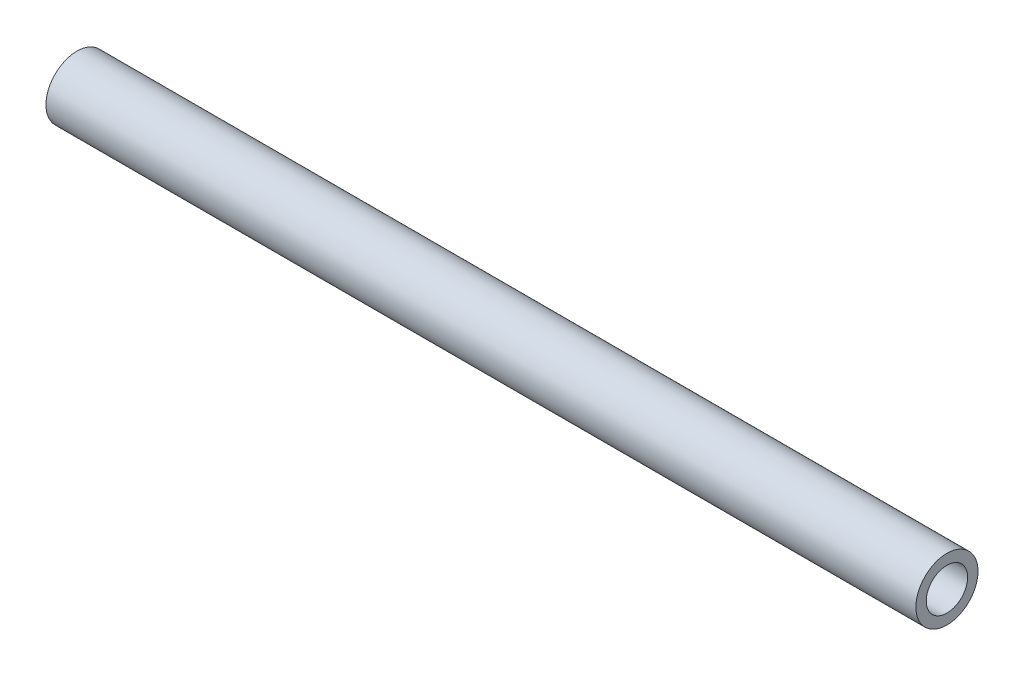
ISO-10303-21;
HEADER;
FILE_DESCRIPTION(('STEP AP214'),'2;1');
FILE_NAME('part.step','',(''),(''),'','','');
FILE_SCHEMA(('AUTOMOTIVE_DESIGN { 1 0 10303 214 1 1 1 1 }'));
ENDSEC;
DATA;
#1=APPLICATION_CONTEXT('core data for automotive mechanical design processes');
#2=APPLICATION_PROTOCOL_DEFINITION('international standard','automotive_design',2000,#1);
#3=PRODUCT_CONTEXT('',#1,'mechanical');
#4=PRODUCT('Part','Part','',(#3));
#5=PRODUCT_RELATED_PRODUCT_CATEGORY('part','',(#4));
#6=PRODUCT_DEFINITION_FORMATION('','',#4);
#7=PRODUCT_DEFINITION_CONTEXT('part definition',#1,'design');
#8=PRODUCT_DEFINITION('design','',#6,#7);
#9=PRODUCT_DEFINITION_SHAPE('','',#8);
#10=(LENGTH_UNIT() NAMED_UNIT(*) SI_UNIT(.MILLI.,.METRE.));
#11=(NAMED_UNIT(*) PLANE_ANGLE_UNIT() SI_UNIT($,.RADIAN.));
#12=(NAMED_UNIT(*) SI_UNIT($,.STERADIAN.) SOLID_ANGLE_UNIT());
#13=UNCERTAINTY_MEASURE_WITH_UNIT(LENGTH_MEASURE(1.E-05),#10,'distance_accuracy_value','');
#14=(GEOMETRIC_REPRESENTATION_CONTEXT(3) GLOBAL_UNCERTAINTY_ASSIGNED_CONTEXT((#13)) GLOBAL_UNIT_ASSIGNED_CONTEXT((#10,
#11,#12)) REPRESENTATION_CONTEXT('',''));
#15=CARTESIAN_POINT('',(0.,0.,0.));
#16=DIRECTION('',(0.,0.,1.));
#17=DIRECTION('',(1.,0.,0.));
#18=AXIS2_PLACEMENT_3D('',#15,#16,#17);
#19=CARTESIAN_POINT('',(266.7,0.,0.));
#20=DIRECTION('',(1.,0.,0.));
#21=DIRECTION('',(0.,0.,-1.));
#22=AXIS2_PLACEMENT_3D('',#19,#20,#21);
#23=PLANE('',#22);
#24=CARTESIAN_POINT('',(266.7,0.,0.));
#25=DIRECTION('',(1.,0.,0.));
#26=DIRECTION('',(0.,0.,-1.));
#27=AXIS2_PLACEMENT_3D('',#24,#25,#26);
#28=CIRCLE('',#27,9.525);
#29=CARTESIAN_POINT('',(266.7,0.,-9.525));
#30=VERTEX_POINT('',#29);
#31=EDGE_CURVE('E10',#30,#30,#28,.T.);
#32=ORIENTED_EDGE('',*,*,#31,.T.);
#33=EDGE_LOOP('',(#32));
#34=FACE_BOUND('',#33,.T.);
#35=CARTESIAN_POINT('',(266.7,0.,0.));
#36=DIRECTION('',(1.,0.,0.));
#37=DIRECTION('',(0.,0.,-1.));
#38=AXIS2_PLACEMENT_3D('',#35,#36,#37);
#39=CIRCLE('',#38,6.35);
#40=CARTESIAN_POINT('',(266.7,0.,-6.35));
#41=VERTEX_POINT('',#40);
#42=EDGE_CURVE('E42',#41,#41,#39,.T.);
#43=ORIENTED_EDGE('',*,*,#42,.F.);
#44=EDGE_LOOP('',(#43));
#45=FACE_BOUND('',#44,.T.);
#46=ADVANCED_FACE('F31',(#34,#45),#23,.T.);
#47=CARTESIAN_POINT('',(0.,0.,0.));
#48=DIRECTION('',(1.,0.,0.));
#49=DIRECTION('',(0.,0.,-1.));
#50=AXIS2_PLACEMENT_3D('',#47,#48,#49);
#51=PLANE('',#50);
#52=CARTESIAN_POINT('',(0.,0.,0.));
#53=DIRECTION('',(1.,0.,0.));
#54=DIRECTION('',(0.,0.,-1.));
#55=AXIS2_PLACEMENT_3D('',#52,#53,#54);
#56=CIRCLE('',#55,9.525);
#57=CARTESIAN_POINT('',(0.,0.,-9.525));
#58=VERTEX_POINT('',#57);
#59=EDGE_CURVE('E35',#58,#58,#56,.T.);
#60=ORIENTED_EDGE('',*,*,#59,.F.);
#61=EDGE_LOOP('',(#60));
#62=FACE_BOUND('',#61,.T.);
#63=CARTESIAN_POINT('',(0.,0.,0.));
#64=DIRECTION('',(1.,0.,0.));
#65=DIRECTION('',(0.,0.,-1.));
#66=AXIS2_PLACEMENT_3D('',#63,#64,#65);
#67=CIRCLE('',#66,6.35);
#68=CARTESIAN_POINT('',(0.,0.,-6.35));
#69=VERTEX_POINT('',#68);
#70=EDGE_CURVE('E44',#69,#69,#67,.T.);
#71=ORIENTED_EDGE('',*,*,#70,.T.);
#72=EDGE_LOOP('',(#71));
#73=FACE_BOUND('',#72,.T.);
#74=ADVANCED_FACE('F54',(#62,#73),#51,.F.);
#75=CARTESIAN_POINT('',(266.7,0.,0.));
#76=DIRECTION('',(-1.,0.,0.));
#77=DIRECTION('',(0.,0.,1.));
#78=AXIS2_PLACEMENT_3D('',#75,#76,#77);
#79=CYLINDRICAL_SURFACE('',#78,9.525);
#80=ORIENTED_EDGE('',*,*,#31,.F.);
#81=EDGE_LOOP('',(#80));
#82=FACE_BOUND('',#81,.T.);
#83=ORIENTED_EDGE('',*,*,#59,.T.);
#84=EDGE_LOOP('',(#83));
#85=FACE_BOUND('',#84,.T.);
#86=ADVANCED_FACE('F33',(#82,#85),#79,.T.);
#87=CARTESIAN_POINT('',(266.7,0.,0.));
#88=DIRECTION('',(-1.,0.,0.));
#89=DIRECTION('',(0.,0.,1.));
#90=AXIS2_PLACEMENT_3D('',#87,#88,#89);
#91=CYLINDRICAL_SURFACE('',#90,6.35);
#92=ORIENTED_EDGE('',*,*,#42,.T.);
#93=EDGE_LOOP('',(#92));
#94=FACE_BOUND('',#93,.T.);
#95=ORIENTED_EDGE('',*,*,#70,.F.);
#96=EDGE_LOOP('',(#95));
#97=FACE_BOUND('',#96,.T.);
#98=ADVANCED_FACE('F50',(#94,#97),#91,.F.);
#99=CLOSED_SHELL('',(#46,#74,#86,#98));
#100=MANIFOLD_SOLID_BREP('B2',#99);
#101=ADVANCED_BREP_SHAPE_REPRESENTATION('',(#18,#100),#14);
#102=SHAPE_DEFINITION_REPRESENTATION(#9,#101);
ENDSEC;
END-ISO-10303-21;
